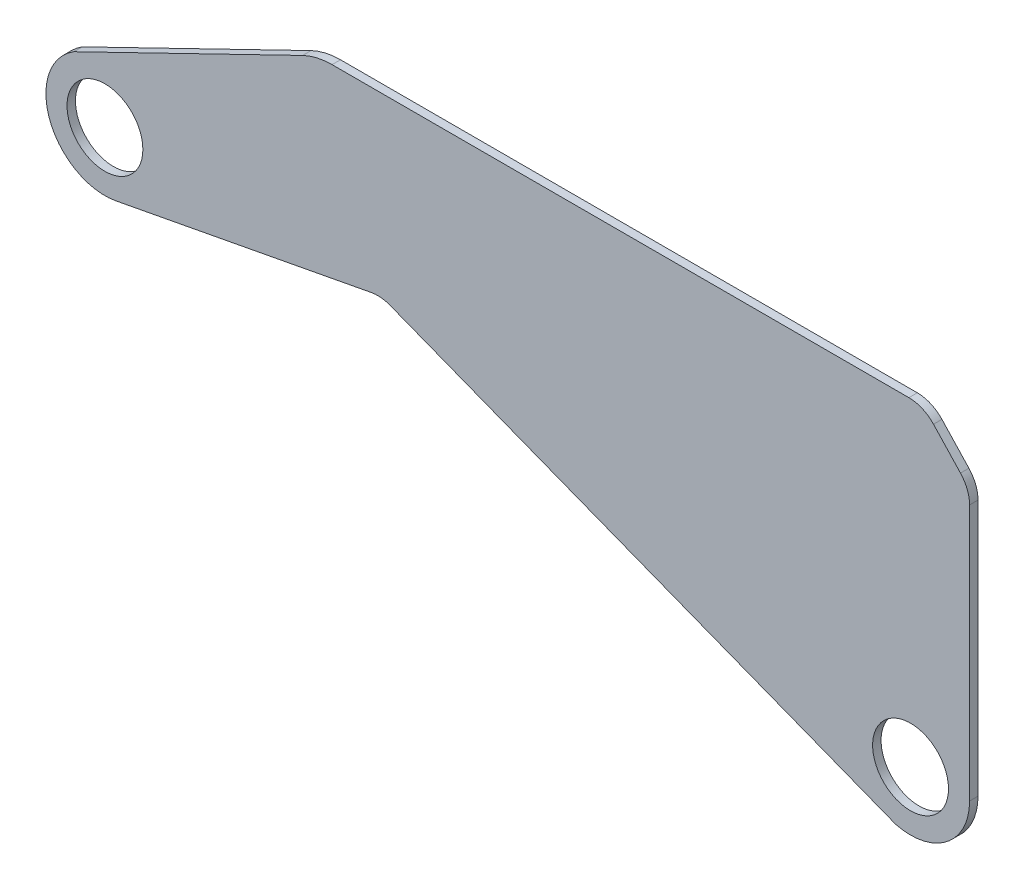
ISO-10303-21;
HEADER;
FILE_DESCRIPTION(('STEP AP214'),'2;1');
FILE_NAME('part.step','',(''),(''),'','','');
FILE_SCHEMA(('AUTOMOTIVE_DESIGN { 1 0 10303 214 1 1 1 1 }'));
ENDSEC;
DATA;
#1=APPLICATION_CONTEXT('core data for automotive mechanical design processes');
#2=APPLICATION_PROTOCOL_DEFINITION('international standard','automotive_design',2000,#1);
#3=PRODUCT_CONTEXT('',#1,'mechanical');
#4=PRODUCT('Part','Part','',(#3));
#5=PRODUCT_RELATED_PRODUCT_CATEGORY('part','',(#4));
#6=PRODUCT_DEFINITION_FORMATION('','',#4);
#7=PRODUCT_DEFINITION_CONTEXT('part definition',#1,'design');
#8=PRODUCT_DEFINITION('design','',#6,#7);
#9=PRODUCT_DEFINITION_SHAPE('','',#8);
#10=(LENGTH_UNIT() NAMED_UNIT(*) SI_UNIT(.MILLI.,.METRE.));
#11=(NAMED_UNIT(*) PLANE_ANGLE_UNIT() SI_UNIT($,.RADIAN.));
#12=(NAMED_UNIT(*) SI_UNIT($,.STERADIAN.) SOLID_ANGLE_UNIT());
#13=UNCERTAINTY_MEASURE_WITH_UNIT(LENGTH_MEASURE(1.E-05),#10,'distance_accuracy_value','');
#14=(GEOMETRIC_REPRESENTATION_CONTEXT(3) GLOBAL_UNCERTAINTY_ASSIGNED_CONTEXT((#13)) GLOBAL_UNIT_ASSIGNED_CONTEXT((#10,
#11,#12)) REPRESENTATION_CONTEXT('',''));
#15=CARTESIAN_POINT('',(0.,0.,0.));
#16=DIRECTION('',(0.,0.,1.));
#17=DIRECTION('',(1.,0.,0.));
#18=AXIS2_PLACEMENT_3D('',#15,#16,#17);
#19=CARTESIAN_POINT('',(-89.9470010414896,185.144778833084,3.175));
#20=DIRECTION('',(0.436980758194094,-0.899470853873607,0.));
#21=DIRECTION('',(0.899470853873607,0.436980758194094,0.));
#22=AXIS2_PLACEMENT_3D('',#19,#20,#21);
#23=PLANE('',#22);
#24=DIRECTION('',(-0.899470853873607,-0.436980758194094,0.));
#25=VECTOR('',#24,1.);
#26=CARTESIAN_POINT('',(-89.9470010414896,185.144778833084,3.175));
#27=LINE('',#26,#25);
#28=CARTESIAN_POINT('',(-228.976859545876,117.601319565641,3.175));
#29=VERTEX_POINT('',#28);
#30=CARTESIAN_POINT('',(-315.107157175411,75.7575148447312,3.175));
#31=VERTEX_POINT('',#30);
#32=EDGE_CURVE('E129',#29,#31,#27,.T.);
#33=ORIENTED_EDGE('',*,*,#32,.F.);
#34=DIRECTION('',(0.,0.,-1.));
#35=VECTOR('',#34,1.);
#36=CARTESIAN_POINT('',(-228.976859545876,117.601319565641,3.175));
#37=LINE('',#36,#35);
#38=CARTESIAN_POINT('',(-228.976859545876,117.601319565641,0.));
#39=VERTEX_POINT('',#38);
#40=EDGE_CURVE('E169',#29,#39,#37,.T.);
#41=ORIENTED_EDGE('',*,*,#40,.T.);
#42=DIRECTION('',(-0.899470853873607,-0.436980758194094,0.));
#43=VECTOR('',#42,1.);
#44=CARTESIAN_POINT('',(-89.9470010414896,185.144778833084,0.));
#45=LINE('',#44,#43);
#46=CARTESIAN_POINT('',(-315.107157175411,75.7575148447312,0.));
#47=VERTEX_POINT('',#46);
#48=EDGE_CURVE('E153',#39,#47,#45,.T.);
#49=ORIENTED_EDGE('',*,*,#48,.T.);
#50=DIRECTION('',(0.,0.,-1.));
#51=VECTOR('',#50,1.);
#52=CARTESIAN_POINT('',(-315.107157175411,75.7575148447312,3.175));
#53=LINE('',#52,#51);
#54=EDGE_CURVE('E146',#31,#47,#53,.T.);
#55=ORIENTED_EDGE('',*,*,#54,.F.);
#56=EDGE_LOOP('',(#33,#41,#49,#55));
#57=FACE_BOUND('',#56,.T.);
#58=ADVANCED_FACE('F41',(#57),#23,.F.);
#59=CARTESIAN_POINT('',(-303.430444421185,56.8470678839822,3.175));
#60=DIRECTION('',(0.,0.,-1.));
#61=DIRECTION('',(-1.,0.,0.));
#62=AXIS2_PLACEMENT_3D('',#59,#60,#61);
#63=CYLINDRICAL_SURFACE('',#62,22.225);
#64=CARTESIAN_POINT('',(-303.430444421185,56.8470678839822,0.));
#65=DIRECTION('',(0.,0.,1.));
#66=DIRECTION('',(1.,0.,0.));
#67=AXIS2_PLACEMENT_3D('',#64,#65,#66);
#68=CIRCLE('',#67,22.225);
#69=CARTESIAN_POINT('',(-299.298978098127,35.0094487138108,0.));
#70=VERTEX_POINT('',#69);
#71=EDGE_CURVE('E232',#47,#70,#68,.T.);
#72=ORIENTED_EDGE('',*,*,#71,.T.);
#73=DIRECTION('',(0.,0.,-1.));
#74=VECTOR('',#73,1.);
#75=CARTESIAN_POINT('',(-299.298978098127,35.0094487138108,3.175));
#76=LINE('',#75,#74);
#77=CARTESIAN_POINT('',(-299.298978098127,35.0094487138108,3.175));
#78=VERTEX_POINT('',#77);
#79=EDGE_CURVE('E148',#78,#70,#76,.T.);
#80=ORIENTED_EDGE('',*,*,#79,.F.);
#81=CARTESIAN_POINT('',(-303.430444421185,56.8470678839822,3.175));
#82=DIRECTION('',(0.,0.,1.));
#83=DIRECTION('',(1.,0.,0.));
#84=AXIS2_PLACEMENT_3D('',#81,#82,#83);
#85=CIRCLE('',#84,22.225);
#86=EDGE_CURVE('E133',#31,#78,#85,.T.);
#87=ORIENTED_EDGE('',*,*,#86,.F.);
#88=ORIENTED_EDGE('',*,*,#54,.T.);
#89=EDGE_LOOP('',(#72,#80,#87,#88));
#90=FACE_BOUND('',#89,.T.);
#91=ADVANCED_FACE('F145',(#90),#63,.T.);
#92=CARTESIAN_POINT('',(-16.7371779379957,88.4674082306973,3.175));
#93=DIRECTION('',(-0.185892747944114,0.982570041402538,0.));
#94=DIRECTION('',(-0.982570041402539,-0.185892747944114,0.));
#95=AXIS2_PLACEMENT_3D('',#92,#93,#94);
#96=PLANE('',#95);
#97=DIRECTION('',(0.982570041402538,0.185892747944114,0.));
#98=VECTOR('',#97,1.);
#99=CARTESIAN_POINT('',(-16.7371779379957,88.4674082306973,0.));
#100=LINE('',#99,#98);
#101=CARTESIAN_POINT('',(-203.043765649032,53.2200038825454,0.));
#102=VERTEX_POINT('',#101);
#103=EDGE_CURVE('E227',#70,#102,#100,.T.);
#104=ORIENTED_EDGE('',*,*,#103,.T.);
#105=DIRECTION('',(0.,0.,-1.));
#106=VECTOR('',#105,1.);
#107=CARTESIAN_POINT('',(-203.043765649032,53.2200038825454,3.175));
#108=LINE('',#107,#106);
#109=CARTESIAN_POINT('',(-203.043765649032,53.2200038825454,3.175));
#110=VERTEX_POINT('',#109);
#111=EDGE_CURVE('E158',#102,#110,#108,.F.);
#112=ORIENTED_EDGE('',*,*,#111,.T.);
#113=DIRECTION('',(0.982570041402538,0.185892747944114,0.));
#114=VECTOR('',#113,1.);
#115=CARTESIAN_POINT('',(-16.7371779379957,88.4674082306973,3.175));
#116=LINE('',#115,#114);
#117=EDGE_CURVE('E150',#78,#110,#116,.T.);
#118=ORIENTED_EDGE('',*,*,#117,.F.);
#119=ORIENTED_EDGE('',*,*,#79,.T.);
#120=EDGE_LOOP('',(#104,#112,#118,#119));
#121=FACE_BOUND('',#120,.T.);
#122=ADVANCED_FACE('F277',(#121),#96,.F.);
#123=CARTESIAN_POINT('',(-7.99746861236985,-20.565009118134,3.175));
#124=DIRECTION('',(0.362444885945906,0.932005206343644,0.));
#125=DIRECTION('',(-0.932005206343644,0.362444885945906,0.));
#126=AXIS2_PLACEMENT_3D('',#123,#124,#125);
#127=PLANE('',#126);
#128=DIRECTION('',(0.932005206343644,-0.362444885945906,0.));
#129=VECTOR('',#128,1.);
#130=CARTESIAN_POINT('',(-7.99746861236985,-20.565009118134,3.175));
#131=LINE('',#130,#129);
#132=CARTESIAN_POINT('',(-196.079877698628,52.5778304772975,3.175));
#133=VERTEX_POINT('',#132);
#134=CARTESIAN_POINT('',(-5.51904950337745,-21.5288345615658,3.175));
#135=VERTEX_POINT('',#134);
#136=EDGE_CURVE('E248',#133,#135,#131,.T.);
#137=ORIENTED_EDGE('',*,*,#136,.F.);
#138=DIRECTION('',(0.,0.,-1.));
#139=VECTOR('',#138,1.);
#140=CARTESIAN_POINT('',(-196.079877698628,52.5778304772975,0.));
#141=LINE('',#140,#139);
#142=CARTESIAN_POINT('',(-196.079877698628,52.5778304772975,0.));
#143=VERTEX_POINT('',#142);
#144=EDGE_CURVE('E155',#133,#143,#141,.T.);
#145=ORIENTED_EDGE('',*,*,#144,.T.);
#146=DIRECTION('',(0.932005206343644,-0.362444885945906,0.));
#147=VECTOR('',#146,1.);
#148=CARTESIAN_POINT('',(-7.99746861236985,-20.565009118134,0.));
#149=LINE('',#148,#147);
#150=CARTESIAN_POINT('',(-5.51904950337745,-21.5288345615658,0.));
#151=VERTEX_POINT('',#150);
#152=EDGE_CURVE('E224',#143,#151,#149,.T.);
#153=ORIENTED_EDGE('',*,*,#152,.T.);
#154=DIRECTION('',(0.,0.,-1.));
#155=VECTOR('',#154,1.);
#156=CARTESIAN_POINT('',(-5.51904950337745,-21.5288345615658,3.175));
#157=LINE('',#156,#155);
#158=EDGE_CURVE('E160',#135,#151,#157,.T.);
#159=ORIENTED_EDGE('',*,*,#158,.F.);
#160=EDGE_LOOP('',(#137,#145,#153,#159));
#161=FACE_BOUND('',#160,.T.);
#162=ADVANCED_FACE('F310',(#161),#127,.F.);
#163=CARTESIAN_POINT('',(0.,0.,3.175));
#164=DIRECTION('',(0.,0.,-1.));
#165=DIRECTION('',(-1.,0.,0.));
#166=AXIS2_PLACEMENT_3D('',#163,#164,#165);
#167=CYLINDRICAL_SURFACE('',#166,22.225);
#168=CARTESIAN_POINT('',(0.,0.,0.));
#169=DIRECTION('',(0.,0.,1.));
#170=DIRECTION('',(1.,0.,0.));
#171=AXIS2_PLACEMENT_3D('',#168,#169,#170);
#172=CIRCLE('',#171,22.225);
#173=CARTESIAN_POINT('',(22.225,0.,0.));
#174=VERTEX_POINT('',#173);
#175=EDGE_CURVE('E218',#151,#174,#172,.T.);
#176=ORIENTED_EDGE('',*,*,#175,.T.);
#177=DIRECTION('',(0.,0.,-1.));
#178=VECTOR('',#177,1.);
#179=CARTESIAN_POINT('',(22.225,0.,3.175));
#180=LINE('',#179,#178);
#181=CARTESIAN_POINT('',(22.225,0.,3.175));
#182=VERTEX_POINT('',#181);
#183=EDGE_CURVE('E209',#182,#174,#180,.T.);
#184=ORIENTED_EDGE('',*,*,#183,.F.);
#185=CARTESIAN_POINT('',(0.,0.,3.175));
#186=DIRECTION('',(0.,0.,1.));
#187=DIRECTION('',(1.,0.,0.));
#188=AXIS2_PLACEMENT_3D('',#185,#186,#187);
#189=CIRCLE('',#188,22.225);
#190=EDGE_CURVE('E219',#135,#182,#189,.T.);
#191=ORIENTED_EDGE('',*,*,#190,.F.);
#192=ORIENTED_EDGE('',*,*,#158,.T.);
#193=EDGE_LOOP('',(#176,#184,#191,#192));
#194=FACE_BOUND('',#193,.T.);
#195=ADVANCED_FACE('F216',(#194),#167,.T.);
#196=CARTESIAN_POINT('',(22.225,0.,3.175));
#197=DIRECTION('',(-1.,0.,0.));
#198=DIRECTION('',(0.,-1.,0.));
#199=AXIS2_PLACEMENT_3D('',#196,#197,#198);
#200=PLANE('',#199);
#201=DIRECTION('',(0.,1.,0.));
#202=VECTOR('',#201,1.);
#203=CARTESIAN_POINT('',(22.225,0.,0.));
#204=LINE('',#203,#202);
#205=CARTESIAN_POINT('',(22.225,96.5881841108285,0.));
#206=VERTEX_POINT('',#205);
#207=EDGE_CURVE('E205',#174,#206,#204,.T.);
#208=ORIENTED_EDGE('',*,*,#207,.T.);
#209=DIRECTION('',(0.,0.,-1.));
#210=VECTOR('',#209,1.);
#211=CARTESIAN_POINT('',(22.225,96.5881841108285,3.175));
#212=LINE('',#211,#210);
#213=CARTESIAN_POINT('',(22.225,96.5881841108285,3.175));
#214=VERTEX_POINT('',#213);
#215=EDGE_CURVE('E183',#206,#214,#212,.F.);
#216=ORIENTED_EDGE('',*,*,#215,.T.);
#217=DIRECTION('',(0.,1.,0.));
#218=VECTOR('',#217,1.);
#219=CARTESIAN_POINT('',(22.225,0.,3.175));
#220=LINE('',#219,#218);
#221=EDGE_CURVE('E244',#182,#214,#220,.T.);
#222=ORIENTED_EDGE('',*,*,#221,.F.);
#223=ORIENTED_EDGE('',*,*,#183,.T.);
#224=EDGE_LOOP('',(#208,#216,#222,#223));
#225=FACE_BOUND('',#224,.T.);
#226=ADVANCED_FACE('F304',(#225),#200,.F.);
#227=CARTESIAN_POINT('',(62.5449460437425,58.4701466874838,3.175));
#228=DIRECTION('',(-0.730502357372089,-0.682910174088672,0.));
#229=DIRECTION('',(0.682910174088672,-0.730502357372089,0.));
#230=AXIS2_PLACEMENT_3D('',#227,#228,#229);
#231=PLANE('',#230);
#232=DIRECTION('',(-0.682910174088672,0.730502357372089,0.));
#233=VECTOR('',#232,1.);
#234=CARTESIAN_POINT('',(62.5449460437425,58.4701466874838,0.));
#235=LINE('',#234,#233);
#236=CARTESIAN_POINT('',(18.8023799386255,105.261143321755,0.));
#237=VERTEX_POINT('',#236);
#238=CARTESIAN_POINT('',(8.64376090953531,116.127719088177,0.));
#239=VERTEX_POINT('',#238);
#240=EDGE_CURVE('E201',#237,#239,#235,.T.);
#241=ORIENTED_EDGE('',*,*,#240,.T.);
#242=DIRECTION('',(0.,0.,-1.));
#243=VECTOR('',#242,1.);
#244=CARTESIAN_POINT('',(8.64376090953532,116.127719088177,3.175));
#245=LINE('',#244,#243);
#246=CARTESIAN_POINT('',(8.64376090953531,116.127719088177,3.175));
#247=VERTEX_POINT('',#246);
#248=EDGE_CURVE('E49',#239,#247,#245,.F.);
#249=ORIENTED_EDGE('',*,*,#248,.T.);
#250=DIRECTION('',(-0.682910174088672,0.730502357372089,0.));
#251=VECTOR('',#250,1.);
#252=CARTESIAN_POINT('',(62.5449460437425,58.4701466874838,3.175));
#253=LINE('',#252,#251);
#254=CARTESIAN_POINT('',(18.8023799386255,105.261143321755,3.175));
#255=VERTEX_POINT('',#254);
#256=EDGE_CURVE('E242',#255,#247,#253,.T.);
#257=ORIENTED_EDGE('',*,*,#256,.F.);
#258=DIRECTION('',(0.,0.,-1.));
#259=VECTOR('',#258,1.);
#260=CARTESIAN_POINT('',(18.8023799386255,105.261143321755,3.175));
#261=LINE('',#260,#259);
#262=EDGE_CURVE('E178',#255,#237,#261,.T.);
#263=ORIENTED_EDGE('',*,*,#262,.T.);
#264=EDGE_LOOP('',(#241,#249,#257,#263));
#265=FACE_BOUND('',#264,.T.);
#266=ADVANCED_FACE('F283',(#265),#231,.F.);
#267=CARTESIAN_POINT('',(0.,0.,3.175));
#268=DIRECTION('',(0.,0.,-1.));
#269=DIRECTION('',(-1.,0.,0.));
#270=AXIS2_PLACEMENT_3D('',#267,#268,#269);
#271=CYLINDRICAL_SURFACE('',#270,14.2875);
#272=CARTESIAN_POINT('',(0.,0.,3.175));
#273=DIRECTION('',(0.,0.,1.));
#274=DIRECTION('',(1.,0.,0.));
#275=AXIS2_PLACEMENT_3D('',#272,#273,#274);
#276=CIRCLE('',#275,14.2875);
#277=CARTESIAN_POINT('',(14.2875,0.,3.175));
#278=VERTEX_POINT('',#277);
#279=EDGE_CURVE('E141',#278,#278,#276,.T.);
#280=ORIENTED_EDGE('',*,*,#279,.T.);
#281=EDGE_LOOP('',(#280));
#282=FACE_BOUND('',#281,.T.);
#283=CARTESIAN_POINT('',(0.,0.,0.));
#284=DIRECTION('',(0.,0.,1.));
#285=DIRECTION('',(1.,0.,0.));
#286=AXIS2_PLACEMENT_3D('',#283,#284,#285);
#287=CIRCLE('',#286,14.2875);
#288=CARTESIAN_POINT('',(14.2875,0.,0.));
#289=VERTEX_POINT('',#288);
#290=EDGE_CURVE('E235',#289,#289,#287,.T.);
#291=ORIENTED_EDGE('',*,*,#290,.F.);
#292=EDGE_LOOP('',(#291));
#293=FACE_BOUND('',#292,.T.);
#294=ADVANCED_FACE('F254',(#282,#293),#271,.F.);
#295=CARTESIAN_POINT('',(-303.430444421185,56.8470678839822,3.175));
#296=DIRECTION('',(0.,0.,-1.));
#297=DIRECTION('',(-1.,0.,0.));
#298=AXIS2_PLACEMENT_3D('',#295,#296,#297);
#299=CYLINDRICAL_SURFACE('',#298,14.2875);
#300=CARTESIAN_POINT('',(-303.430444421185,56.8470678839822,3.175));
#301=DIRECTION('',(0.,0.,1.));
#302=DIRECTION('',(1.,0.,0.));
#303=AXIS2_PLACEMENT_3D('',#300,#301,#302);
#304=CIRCLE('',#303,14.2875);
#305=CARTESIAN_POINT('',(-289.142944421185,56.8470678839822,3.175));
#306=VERTEX_POINT('',#305);
#307=EDGE_CURVE('E200',#306,#306,#304,.T.);
#308=ORIENTED_EDGE('',*,*,#307,.T.);
#309=EDGE_LOOP('',(#308));
#310=FACE_BOUND('',#309,.T.);
#311=CARTESIAN_POINT('',(-303.430444421185,56.8470678839822,0.));
#312=DIRECTION('',(0.,0.,1.));
#313=DIRECTION('',(1.,0.,0.));
#314=AXIS2_PLACEMENT_3D('',#311,#312,#313);
#315=CIRCLE('',#314,14.2875);
#316=CARTESIAN_POINT('',(-289.142944421185,56.8470678839822,0.));
#317=VERTEX_POINT('',#316);
#318=EDGE_CURVE('E238',#317,#317,#315,.T.);
#319=ORIENTED_EDGE('',*,*,#318,.F.);
#320=EDGE_LOOP('',(#319));
#321=FACE_BOUND('',#320,.T.);
#322=ADVANCED_FACE('F267',(#310,#321),#299,.F.);
#323=CARTESIAN_POINT('',(0.,120.154759877251,3.175));
#324=DIRECTION('',(0.,-1.,0.));
#325=DIRECTION('',(0.,0.,-1.));
#326=AXIS2_PLACEMENT_3D('',#323,#324,#325);
#327=PLANE('',#326);
#328=DIRECTION('',(-1.,0.,0.));
#329=VECTOR('',#328,1.);
#330=CARTESIAN_POINT('',(0.,120.154759877251,3.175));
#331=LINE('',#330,#329);
#332=CARTESIAN_POINT('',(-0.633619029090221,120.154759877251,3.175));
#333=VERTEX_POINT('',#332);
#334=CARTESIAN_POINT('',(-217.877548287746,120.154759877251,3.175));
#335=VERTEX_POINT('',#334);
#336=EDGE_CURVE('E195',#333,#335,#331,.T.);
#337=ORIENTED_EDGE('',*,*,#336,.F.);
#338=DIRECTION('',(0.,0.,-1.));
#339=VECTOR('',#338,1.);
#340=CARTESIAN_POINT('',(-0.633619029090221,120.154759877251,3.175));
#341=LINE('',#340,#339);
#342=CARTESIAN_POINT('',(-0.633619029090221,120.154759877251,0.));
#343=VERTEX_POINT('',#342);
#344=EDGE_CURVE('E187',#333,#343,#341,.T.);
#345=ORIENTED_EDGE('',*,*,#344,.T.);
#346=DIRECTION('',(-1.,0.,0.));
#347=VECTOR('',#346,1.);
#348=CARTESIAN_POINT('',(0.,120.154759877251,0.));
#349=LINE('',#348,#347);
#350=CARTESIAN_POINT('',(-217.877548287746,120.154759877251,0.));
#351=VERTEX_POINT('',#350);
#352=EDGE_CURVE('E194',#343,#351,#349,.T.);
#353=ORIENTED_EDGE('',*,*,#352,.T.);
#354=DIRECTION('',(0.,0.,-1.));
#355=VECTOR('',#354,1.);
#356=CARTESIAN_POINT('',(-217.877548287746,120.154759877251,3.175));
#357=LINE('',#356,#355);
#358=EDGE_CURVE('E174',#351,#335,#357,.F.);
#359=ORIENTED_EDGE('',*,*,#358,.T.);
#360=EDGE_LOOP('',(#337,#345,#353,#359));
#361=FACE_BOUND('',#360,.T.);
#362=ADVANCED_FACE('F193',(#361),#327,.F.);
#363=CARTESIAN_POINT('',(0.,0.,3.175));
#364=DIRECTION('',(0.,0.,1.));
#365=DIRECTION('',(1.,0.,0.));
#366=AXIS2_PLACEMENT_3D('',#363,#364,#365);
#367=PLANE('',#366);
#368=ORIENTED_EDGE('',*,*,#307,.F.);
#369=EDGE_LOOP('',(#368));
#370=FACE_BOUND('',#369,.T.);
#371=ORIENTED_EDGE('',*,*,#279,.F.);
#372=EDGE_LOOP('',(#371));
#373=FACE_BOUND('',#372,.T.);
#374=ORIENTED_EDGE('',*,*,#256,.T.);
#375=CARTESIAN_POINT('',(-0.633619029090221,107.454759877251,3.175));
#376=DIRECTION('',(0.,0.,1.));
#377=DIRECTION('',(1.,0.,0.));
#378=AXIS2_PLACEMENT_3D('',#375,#376,#377);
#379=CIRCLE('',#378,12.7);
#380=EDGE_CURVE('E11',#247,#333,#379,.T.);
#381=ORIENTED_EDGE('',*,*,#380,.T.);
#382=ORIENTED_EDGE('',*,*,#336,.T.);
#383=CARTESIAN_POINT('',(-217.877548287746,94.7547598772511,3.175));
#384=DIRECTION('',(0.,0.,1.));
#385=DIRECTION('',(1.,0.,0.));
#386=AXIS2_PLACEMENT_3D('',#383,#384,#385);
#387=CIRCLE('',#386,25.4);
#388=EDGE_CURVE('E136',#335,#29,#387,.T.);
#389=ORIENTED_EDGE('',*,*,#388,.T.);
#390=ORIENTED_EDGE('',*,*,#32,.T.);
#391=ORIENTED_EDGE('',*,*,#86,.T.);
#392=ORIENTED_EDGE('',*,*,#117,.T.);
#393=CARTESIAN_POINT('',(-200.682927750141,40.7413643567332,3.175));
#394=DIRECTION('',(0.,0.,1.));
#395=DIRECTION('',(1.,0.,0.));
#396=AXIS2_PLACEMENT_3D('',#393,#394,#395);
#397=CIRCLE('',#396,12.7);
#398=EDGE_CURVE('E167',#110,#133,#397,.F.);
#399=ORIENTED_EDGE('',*,*,#398,.T.);
#400=ORIENTED_EDGE('',*,*,#136,.T.);
#401=ORIENTED_EDGE('',*,*,#190,.T.);
#402=ORIENTED_EDGE('',*,*,#221,.T.);
#403=CARTESIAN_POINT('',(9.525,96.5881841108285,3.175));
#404=DIRECTION('',(0.,0.,1.));
#405=DIRECTION('',(1.,0.,0.));
#406=AXIS2_PLACEMENT_3D('',#403,#404,#405);
#407=CIRCLE('',#406,12.7);
#408=EDGE_CURVE('E185',#214,#255,#407,.T.);
#409=ORIENTED_EDGE('',*,*,#408,.T.);
#410=EDGE_LOOP('',(#374,#381,#382,#389,#390,#391,#392,#399,#400,#401,#402,#409));
#411=FACE_BOUND('',#410,.T.);
#412=ADVANCED_FACE('F131',(#370,#373,#411),#367,.T.);
#413=CARTESIAN_POINT('',(0.,0.,0.));
#414=DIRECTION('',(0.,0.,1.));
#415=DIRECTION('',(1.,0.,0.));
#416=AXIS2_PLACEMENT_3D('',#413,#414,#415);
#417=PLANE('',#416);
#418=ORIENTED_EDGE('',*,*,#318,.T.);
#419=EDGE_LOOP('',(#418));
#420=FACE_BOUND('',#419,.T.);
#421=ORIENTED_EDGE('',*,*,#290,.T.);
#422=EDGE_LOOP('',(#421));
#423=FACE_BOUND('',#422,.T.);
#424=ORIENTED_EDGE('',*,*,#352,.F.);
#425=CARTESIAN_POINT('',(-0.633619029090221,107.454759877251,0.));
#426=DIRECTION('',(0.,0.,1.));
#427=DIRECTION('',(1.,0.,0.));
#428=AXIS2_PLACEMENT_3D('',#425,#426,#427);
#429=CIRCLE('',#428,12.7);
#430=EDGE_CURVE('E63',#343,#239,#429,.F.);
#431=ORIENTED_EDGE('',*,*,#430,.T.);
#432=ORIENTED_EDGE('',*,*,#240,.F.);
#433=CARTESIAN_POINT('',(9.525,96.5881841108285,0.));
#434=DIRECTION('',(0.,0.,1.));
#435=DIRECTION('',(1.,0.,0.));
#436=AXIS2_PLACEMENT_3D('',#433,#434,#435);
#437=CIRCLE('',#436,12.7);
#438=EDGE_CURVE('E181',#237,#206,#437,.F.);
#439=ORIENTED_EDGE('',*,*,#438,.T.);
#440=ORIENTED_EDGE('',*,*,#207,.F.);
#441=ORIENTED_EDGE('',*,*,#175,.F.);
#442=ORIENTED_EDGE('',*,*,#152,.F.);
#443=CARTESIAN_POINT('',(-200.682927750141,40.7413643567332,0.));
#444=DIRECTION('',(0.,0.,1.));
#445=DIRECTION('',(1.,0.,0.));
#446=AXIS2_PLACEMENT_3D('',#443,#444,#445);
#447=CIRCLE('',#446,12.7);
#448=EDGE_CURVE('E165',#143,#102,#447,.T.);
#449=ORIENTED_EDGE('',*,*,#448,.T.);
#450=ORIENTED_EDGE('',*,*,#103,.F.);
#451=ORIENTED_EDGE('',*,*,#71,.F.);
#452=ORIENTED_EDGE('',*,*,#48,.F.);
#453=CARTESIAN_POINT('',(-217.877548287746,94.7547598772511,0.));
#454=DIRECTION('',(0.,0.,1.));
#455=DIRECTION('',(1.,0.,0.));
#456=AXIS2_PLACEMENT_3D('',#453,#454,#455);
#457=CIRCLE('',#456,25.4);
#458=EDGE_CURVE('E171',#39,#351,#457,.F.);
#459=ORIENTED_EDGE('',*,*,#458,.T.);
#460=EDGE_LOOP('',(#424,#431,#432,#439,#440,#441,#442,#449,#450,#451,#452,#459));
#461=FACE_BOUND('',#460,.T.);
#462=ADVANCED_FACE('F198',(#420,#423,#461),#417,.F.);
#463=CARTESIAN_POINT('',(-200.682927750141,40.7413643567332,3.175));
#464=DIRECTION('',(0.,0.,1.));
#465=DIRECTION('',(1.,0.,0.));
#466=AXIS2_PLACEMENT_3D('',#463,#464,#465);
#467=CYLINDRICAL_SURFACE('',#466,12.7);
#468=ORIENTED_EDGE('',*,*,#398,.F.);
#469=ORIENTED_EDGE('',*,*,#111,.F.);
#470=ORIENTED_EDGE('',*,*,#448,.F.);
#471=ORIENTED_EDGE('',*,*,#144,.F.);
#472=EDGE_LOOP('',(#468,#469,#470,#471));
#473=FACE_BOUND('',#472,.T.);
#474=ADVANCED_FACE('F264',(#473),#467,.F.);
#475=CARTESIAN_POINT('',(-217.877548287746,94.7547598772511,3.175));
#476=DIRECTION('',(0.,0.,-1.));
#477=DIRECTION('',(-1.,0.,0.));
#478=AXIS2_PLACEMENT_3D('',#475,#476,#477);
#479=CYLINDRICAL_SURFACE('',#478,25.4);
#480=ORIENTED_EDGE('',*,*,#388,.F.);
#481=ORIENTED_EDGE('',*,*,#358,.F.);
#482=ORIENTED_EDGE('',*,*,#458,.F.);
#483=ORIENTED_EDGE('',*,*,#40,.F.);
#484=EDGE_LOOP('',(#480,#481,#482,#483));
#485=FACE_BOUND('',#484,.T.);
#486=ADVANCED_FACE('F288',(#485),#479,.T.);
#487=CARTESIAN_POINT('',(9.525,96.5881841108285,3.175));
#488=DIRECTION('',(0.,0.,-1.));
#489=DIRECTION('',(-1.,0.,0.));
#490=AXIS2_PLACEMENT_3D('',#487,#488,#489);
#491=CYLINDRICAL_SURFACE('',#490,12.7);
#492=ORIENTED_EDGE('',*,*,#408,.F.);
#493=ORIENTED_EDGE('',*,*,#215,.F.);
#494=ORIENTED_EDGE('',*,*,#438,.F.);
#495=ORIENTED_EDGE('',*,*,#262,.F.);
#496=EDGE_LOOP('',(#492,#493,#494,#495));
#497=FACE_BOUND('',#496,.T.);
#498=ADVANCED_FACE('F290',(#497),#491,.T.);
#499=CARTESIAN_POINT('',(-0.633619029090221,107.454759877251,3.175));
#500=DIRECTION('',(0.,0.,-1.));
#501=DIRECTION('',(-1.,0.,0.));
#502=AXIS2_PLACEMENT_3D('',#499,#500,#501);
#503=CYLINDRICAL_SURFACE('',#502,12.7);
#504=ORIENTED_EDGE('',*,*,#380,.F.);
#505=ORIENTED_EDGE('',*,*,#248,.F.);
#506=ORIENTED_EDGE('',*,*,#430,.F.);
#507=ORIENTED_EDGE('',*,*,#344,.F.);
#508=EDGE_LOOP('',(#504,#505,#506,#507));
#509=FACE_BOUND('',#508,.T.);
#510=ADVANCED_FACE('F43',(#509),#503,.T.);
#511=CLOSED_SHELL('',(#58,#91,#122,#162,#195,#226,#266,#294,#322,#362,#412,#462,#474,#486,#498,#510));
#512=MANIFOLD_SOLID_BREP('B2',#511);
#513=ADVANCED_BREP_SHAPE_REPRESENTATION('',(#18,#512),#14);
#514=SHAPE_DEFINITION_REPRESENTATION(#9,#513);
ENDSEC;
END-ISO-10303-21;
